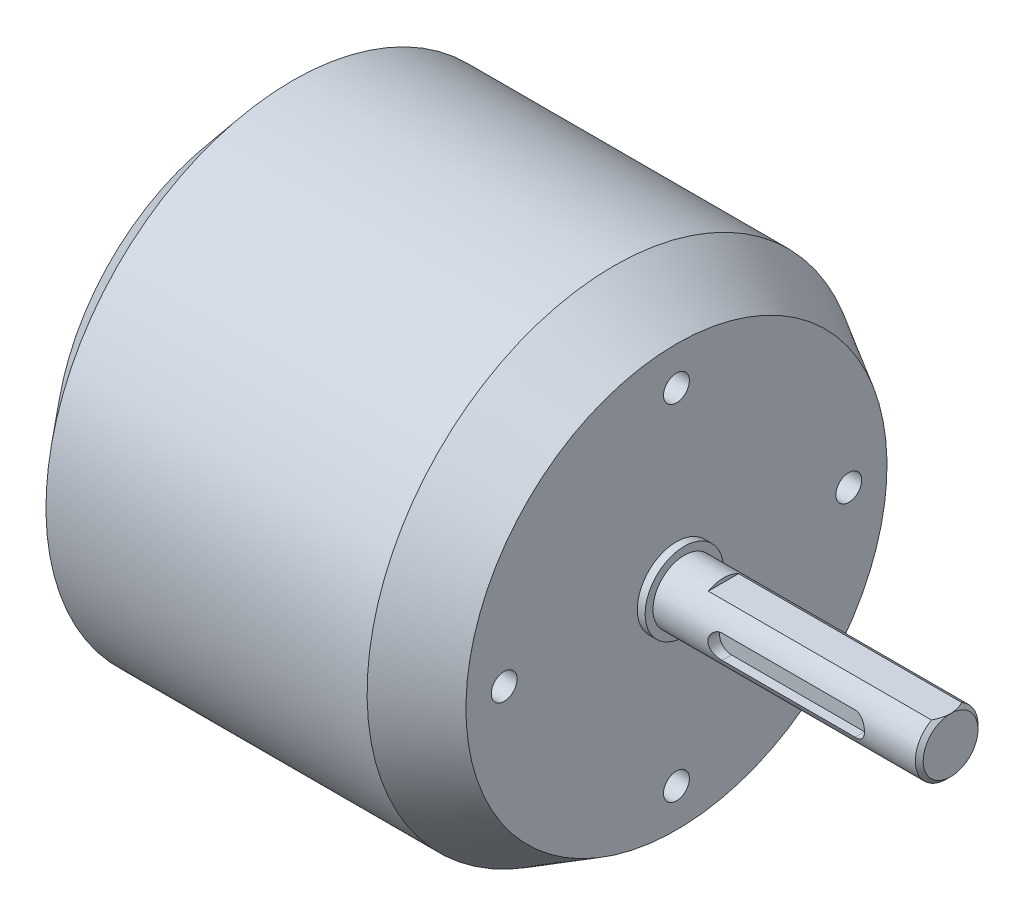
ISO-10303-21;
HEADER;
FILE_DESCRIPTION(('STEP AP214'),'2;1');
FILE_NAME('part.step','',(''),(''),'','','');
FILE_SCHEMA(('AUTOMOTIVE_DESIGN { 1 0 10303 214 1 1 1 1 }'));
ENDSEC;
DATA;
#1=APPLICATION_CONTEXT('core data for automotive mechanical design processes');
#2=APPLICATION_PROTOCOL_DEFINITION('international standard','automotive_design',2000,#1);
#3=PRODUCT_CONTEXT('',#1,'mechanical');
#4=PRODUCT('Part','Part','',(#3));
#5=PRODUCT_RELATED_PRODUCT_CATEGORY('part','',(#4));
#6=PRODUCT_DEFINITION_FORMATION('','',#4);
#7=PRODUCT_DEFINITION_CONTEXT('part definition',#1,'design');
#8=PRODUCT_DEFINITION('design','',#6,#7);
#9=PRODUCT_DEFINITION_SHAPE('','',#8);
#10=(LENGTH_UNIT() NAMED_UNIT(*) SI_UNIT(.MILLI.,.METRE.));
#11=(NAMED_UNIT(*) PLANE_ANGLE_UNIT() SI_UNIT($,.RADIAN.));
#12=(NAMED_UNIT(*) SI_UNIT($,.STERADIAN.) SOLID_ANGLE_UNIT());
#13=UNCERTAINTY_MEASURE_WITH_UNIT(LENGTH_MEASURE(1.E-05),#10,'distance_accuracy_value','');
#14=(GEOMETRIC_REPRESENTATION_CONTEXT(3) GLOBAL_UNCERTAINTY_ASSIGNED_CONTEXT((#13)) GLOBAL_UNIT_ASSIGNED_CONTEXT((#10,
#11,#12)) REPRESENTATION_CONTEXT('',''));
#15=CARTESIAN_POINT('',(0.,0.,0.));
#16=DIRECTION('',(0.,0.,1.));
#17=DIRECTION('',(1.,0.,0.));
#18=AXIS2_PLACEMENT_3D('',#15,#16,#17);
#19=CARTESIAN_POINT('',(-27.5,0.,0.));
#20=DIRECTION('',(-1.,0.,0.));
#21=DIRECTION('',(0.,-1.,0.));
#22=AXIS2_PLACEMENT_3D('',#19,#20,#21);
#23=PLANE('',#22);
#24=CARTESIAN_POINT('',(-27.5,0.,0.));
#25=DIRECTION('',(1.,0.,0.));
#26=DIRECTION('',(0.,1.,0.));
#27=AXIS2_PLACEMENT_3D('',#24,#25,#26);
#28=CIRCLE('',#27,24.3494784444348);
#29=CARTESIAN_POINT('',(-27.5,24.3494784444348,0.));
#30=VERTEX_POINT('',#29);
#31=EDGE_CURVE('E177',#30,#30,#28,.T.);
#32=ORIENTED_EDGE('',*,*,#31,.F.);
#33=EDGE_LOOP('',(#32));
#34=FACE_BOUND('',#33,.T.);
#35=ADVANCED_FACE('F46',(#34),#23,.T.);
#36=CARTESIAN_POINT('',(-21.5,0.,0.));
#37=DIRECTION('',(1.,0.,0.));
#38=DIRECTION('',(0.,1.,0.));
#39=AXIS2_PLACEMENT_3D('',#36,#37,#38);
#40=CONICAL_SURFACE('',#39,31.5,0.872664625997165);
#41=ORIENTED_EDGE('',*,*,#31,.T.);
#42=EDGE_LOOP('',(#41));
#43=FACE_BOUND('',#42,.T.);
#44=CARTESIAN_POINT('',(-21.5,0.,0.));
#45=DIRECTION('',(1.,0.,0.));
#46=DIRECTION('',(0.,1.,0.));
#47=AXIS2_PLACEMENT_3D('',#44,#45,#46);
#48=CIRCLE('',#47,31.5);
#49=CARTESIAN_POINT('',(-21.5,31.5,0.));
#50=VERTEX_POINT('',#49);
#51=EDGE_CURVE('E219',#50,#50,#48,.T.);
#52=ORIENTED_EDGE('',*,*,#51,.F.);
#53=EDGE_LOOP('',(#52));
#54=FACE_BOUND('',#53,.T.);
#55=ADVANCED_FACE('F209',(#43,#54),#40,.T.);
#56=CARTESIAN_POINT('',(27.5,0.,0.));
#57=DIRECTION('',(1.,0.,0.));
#58=DIRECTION('',(0.,1.,0.));
#59=AXIS2_PLACEMENT_3D('',#56,#57,#58);
#60=CYLINDRICAL_SURFACE('',#59,31.5);
#61=ORIENTED_EDGE('',*,*,#51,.T.);
#62=EDGE_LOOP('',(#61));
#63=FACE_BOUND('',#62,.T.);
#64=CARTESIAN_POINT('',(19.5,0.,0.));
#65=DIRECTION('',(1.,0.,0.));
#66=DIRECTION('',(0.,1.,0.));
#67=AXIS2_PLACEMENT_3D('',#64,#65,#66);
#68=CIRCLE('',#67,31.5);
#69=CARTESIAN_POINT('',(19.5,31.5,0.));
#70=VERTEX_POINT('',#69);
#71=EDGE_CURVE('E221',#70,#70,#68,.T.);
#72=ORIENTED_EDGE('',*,*,#71,.F.);
#73=EDGE_LOOP('',(#72));
#74=FACE_BOUND('',#73,.T.);
#75=ADVANCED_FACE('F205',(#63,#74),#60,.T.);
#76=CARTESIAN_POINT('',(27.5,0.,0.));
#77=DIRECTION('',(-1.,0.,0.));
#78=DIRECTION('',(0.,-1.,0.));
#79=AXIS2_PLACEMENT_3D('',#76,#77,#78);
#80=CONICAL_SURFACE('',#79,26.881197846483,0.523598775598296);
#81=ORIENTED_EDGE('',*,*,#71,.T.);
#82=EDGE_LOOP('',(#81));
#83=FACE_BOUND('',#82,.T.);
#84=CARTESIAN_POINT('',(27.5,0.,0.));
#85=DIRECTION('',(1.,0.,0.));
#86=DIRECTION('',(0.,1.,0.));
#87=AXIS2_PLACEMENT_3D('',#84,#85,#86);
#88=CIRCLE('',#87,26.881197846483);
#89=CARTESIAN_POINT('',(27.5,26.881197846483,0.));
#90=VERTEX_POINT('',#89);
#91=EDGE_CURVE('E224',#90,#90,#88,.T.);
#92=ORIENTED_EDGE('',*,*,#91,.F.);
#93=EDGE_LOOP('',(#92));
#94=FACE_BOUND('',#93,.T.);
#95=ADVANCED_FACE('F201',(#83,#94),#80,.T.);
#96=CARTESIAN_POINT('',(27.5,26.881197846483,0.));
#97=DIRECTION('',(1.,0.,0.));
#98=DIRECTION('',(0.,1.,0.));
#99=AXIS2_PLACEMENT_3D('',#96,#97,#98);
#100=PLANE('',#99);
#101=CARTESIAN_POINT('',(27.5,22.,0.));
#102=DIRECTION('',(1.,0.,0.));
#103=DIRECTION('',(0.,0.,-1.));
#104=AXIS2_PLACEMENT_3D('',#101,#102,#103);
#105=CIRCLE('',#104,1.65);
#106=CARTESIAN_POINT('',(27.5,22.,-1.65));
#107=VERTEX_POINT('',#106);
#108=EDGE_CURVE('E259',#107,#107,#105,.T.);
#109=ORIENTED_EDGE('',*,*,#108,.F.);
#110=EDGE_LOOP('',(#109));
#111=FACE_BOUND('',#110,.T.);
#112=CARTESIAN_POINT('',(27.5,-22.,0.));
#113=DIRECTION('',(1.,0.,0.));
#114=DIRECTION('',(0.,0.,-1.));
#115=AXIS2_PLACEMENT_3D('',#112,#113,#114);
#116=CIRCLE('',#115,1.65);
#117=CARTESIAN_POINT('',(27.5,-22.,-1.65));
#118=VERTEX_POINT('',#117);
#119=EDGE_CURVE('E253',#118,#118,#116,.T.);
#120=ORIENTED_EDGE('',*,*,#119,.F.);
#121=EDGE_LOOP('',(#120));
#122=FACE_BOUND('',#121,.T.);
#123=CARTESIAN_POINT('',(27.5,0.,-22.));
#124=DIRECTION('',(1.,0.,0.));
#125=DIRECTION('',(0.,0.,-1.));
#126=AXIS2_PLACEMENT_3D('',#123,#124,#125);
#127=CIRCLE('',#126,1.65);
#128=CARTESIAN_POINT('',(27.5,0.,-23.65));
#129=VERTEX_POINT('',#128);
#130=EDGE_CURVE('E247',#129,#129,#127,.T.);
#131=ORIENTED_EDGE('',*,*,#130,.F.);
#132=EDGE_LOOP('',(#131));
#133=FACE_BOUND('',#132,.T.);
#134=CARTESIAN_POINT('',(27.5,0.,22.));
#135=DIRECTION('',(1.,0.,0.));
#136=DIRECTION('',(0.,0.,-1.));
#137=AXIS2_PLACEMENT_3D('',#134,#135,#136);
#138=CIRCLE('',#137,1.65);
#139=CARTESIAN_POINT('',(27.5,0.,20.35));
#140=VERTEX_POINT('',#139);
#141=EDGE_CURVE('E241',#140,#140,#138,.T.);
#142=ORIENTED_EDGE('',*,*,#141,.F.);
#143=EDGE_LOOP('',(#142));
#144=FACE_BOUND('',#143,.T.);
#145=CARTESIAN_POINT('',(27.5,0.,0.));
#146=DIRECTION('',(1.,0.,0.));
#147=DIRECTION('',(0.,1.,0.));
#148=AXIS2_PLACEMENT_3D('',#145,#146,#147);
#149=CIRCLE('',#148,5.);
#150=CARTESIAN_POINT('',(27.5,5.00000000000001,0.));
#151=VERTEX_POINT('',#150);
#152=EDGE_CURVE('E230',#151,#151,#149,.T.);
#153=ORIENTED_EDGE('',*,*,#152,.F.);
#154=EDGE_LOOP('',(#153));
#155=FACE_BOUND('',#154,.T.);
#156=ORIENTED_EDGE('',*,*,#91,.T.);
#157=EDGE_LOOP('',(#156));
#158=FACE_BOUND('',#157,.T.);
#159=ADVANCED_FACE('F194',(#111,#122,#133,#144,#155,#158),#100,.T.);
#160=CARTESIAN_POINT('',(28.5,0.,0.));
#161=DIRECTION('',(1.,0.,0.));
#162=DIRECTION('',(0.,1.,0.));
#163=AXIS2_PLACEMENT_3D('',#160,#161,#162);
#164=PLANE('',#163);
#165=CARTESIAN_POINT('',(28.5,0.,0.));
#166=DIRECTION('',(1.,0.,0.));
#167=DIRECTION('',(0.,1.,0.));
#168=AXIS2_PLACEMENT_3D('',#165,#166,#167);
#169=CIRCLE('',#168,5.);
#170=CARTESIAN_POINT('',(28.5,5.00000000000001,0.));
#171=VERTEX_POINT('',#170);
#172=EDGE_CURVE('E229',#171,#171,#169,.T.);
#173=ORIENTED_EDGE('',*,*,#172,.T.);
#174=EDGE_LOOP('',(#173));
#175=FACE_BOUND('',#174,.T.);
#176=CARTESIAN_POINT('',(28.5,0.,0.));
#177=DIRECTION('',(1.,0.,0.));
#178=DIRECTION('',(0.,1.,0.));
#179=AXIS2_PLACEMENT_3D('',#176,#177,#178);
#180=CIRCLE('',#179,4.);
#181=CARTESIAN_POINT('',(28.5,4.00000000000001,0.));
#182=VERTEX_POINT('',#181);
#183=EDGE_CURVE('E233',#182,#182,#180,.T.);
#184=ORIENTED_EDGE('',*,*,#183,.F.);
#185=EDGE_LOOP('',(#184));
#186=FACE_BOUND('',#185,.T.);
#187=ADVANCED_FACE('F190',(#175,#186),#164,.T.);
#188=CARTESIAN_POINT('',(28.5,0.,0.));
#189=DIRECTION('',(-1.,0.,0.));
#190=DIRECTION('',(0.,-1.,0.));
#191=AXIS2_PLACEMENT_3D('',#188,#189,#190);
#192=CYLINDRICAL_SURFACE('',#191,5.);
#193=ORIENTED_EDGE('',*,*,#172,.F.);
#194=EDGE_LOOP('',(#193));
#195=FACE_BOUND('',#194,.T.);
#196=ORIENTED_EDGE('',*,*,#152,.T.);
#197=EDGE_LOOP('',(#196));
#198=FACE_BOUND('',#197,.T.);
#199=ADVANCED_FACE('F188',(#195,#198),#192,.T.);
#200=CARTESIAN_POINT('',(62.5,0.,0.));
#201=DIRECTION('',(-1.,0.,0.));
#202=DIRECTION('',(0.,-1.,0.));
#203=AXIS2_PLACEMENT_3D('',#200,#201,#202);
#204=CYLINDRICAL_SURFACE('',#203,4.);
#205=DIRECTION('',(-1.,0.,0.));
#206=VECTOR('',#205,1.);
#207=CARTESIAN_POINT('',(62.5,3.50000000000002,-1.93649167310371));
#208=LINE('',#207,#206);
#209=CARTESIAN_POINT('',(33.5,3.50000000000001,-1.93649167310371));
#210=VERTEX_POINT('',#209);
#211=CARTESIAN_POINT('',(62.,3.50000000000002,-1.93649167310371));
#212=VERTEX_POINT('',#211);
#213=EDGE_CURVE('E111',#210,#212,#208,.F.);
#214=ORIENTED_EDGE('',*,*,#213,.T.);
#215=CARTESIAN_POINT('',(62.,0.,0.));
#216=DIRECTION('',(1.,0.,0.));
#217=DIRECTION('',(0.,1.,0.));
#218=AXIS2_PLACEMENT_3D('',#215,#216,#217);
#219=CIRCLE('',#218,4.);
#220=CARTESIAN_POINT('',(62.,3.50000000000002,1.93649167310371));
#221=VERTEX_POINT('',#220);
#222=EDGE_CURVE('E13',#212,#221,#219,.F.);
#223=ORIENTED_EDGE('',*,*,#222,.T.);
#224=DIRECTION('',(-1.,0.,0.));
#225=VECTOR('',#224,1.);
#226=CARTESIAN_POINT('',(62.5,3.50000000000002,1.93649167310371));
#227=LINE('',#226,#225);
#228=CARTESIAN_POINT('',(33.5,3.50000000000001,1.93649167310371));
#229=VERTEX_POINT('',#228);
#230=EDGE_CURVE('E116',#221,#229,#227,.T.);
#231=ORIENTED_EDGE('',*,*,#230,.T.);
#232=CARTESIAN_POINT('',(33.5,0.,0.));
#233=DIRECTION('',(1.,0.,0.));
#234=DIRECTION('',(0.,1.,0.));
#235=AXIS2_PLACEMENT_3D('',#232,#233,#234);
#236=CIRCLE('',#235,4.);
#237=EDGE_CURVE('E121',#210,#229,#236,.T.);
#238=ORIENTED_EDGE('',*,*,#237,.F.);
#239=EDGE_LOOP('',(#214,#223,#231,#238));
#240=FACE_BOUND('',#239,.T.);
#241=DIRECTION('',(-1.,0.,0.));
#242=VECTOR('',#241,1.);
#243=CARTESIAN_POINT('',(62.5,1.50625,3.70556486078709));
#244=LINE('',#243,#242);
#245=CARTESIAN_POINT('',(37.00625,1.50625,3.70556486078709));
#246=VERTEX_POINT('',#245);
#247=CARTESIAN_POINT('',(53.99375,1.50625,3.70556486078709));
#248=VERTEX_POINT('',#247);
#249=EDGE_CURVE('E126',#246,#248,#244,.F.);
#250=ORIENTED_EDGE('',*,*,#249,.T.);
#251=CARTESIAN_POINT('',(53.99375,1.50625,3.70556486078709));
#252=CARTESIAN_POINT('',(54.0344978928587,1.50625151862187,3.70556000319242));
#253=CARTESIAN_POINT('',(54.075224550686,1.50459543076368,3.70623782920084));
#254=CARTESIAN_POINT('',(54.1563541437584,1.49800041962785,3.70891005643462));
#255=CARTESIAN_POINT('',(54.1967571838838,1.49306260741055,3.71090401206969));
#256=CARTESIAN_POINT('',(54.3167446695935,1.47343167916475,3.71876432059648));
#257=CARTESIAN_POINT('',(54.3954737827407,1.45392039257432,3.72650998337));
#258=CARTESIAN_POINT('',(54.548215470731,1.40280121489189,3.74604926216923));
#259=CARTESIAN_POINT('',(54.6222320124237,1.37120365885237,3.75783941883398));
#260=CARTESIAN_POINT('',(54.7639924221759,1.29689045665855,3.78412808205282));
#261=CARTESIAN_POINT('',(54.8317310427329,1.25416562122484,3.79862882429214));
#262=CARTESIAN_POINT('',(54.9623326748097,1.15653903397746,3.8295103762707));
#263=CARTESIAN_POINT('',(55.0248355957786,1.10117317738226,3.84594660753066));
#264=CARTESIAN_POINT('',(55.1399242842702,0.980820017970887,3.87838535976546));
#265=CARTESIAN_POINT('',(55.1925081253848,0.915830850554564,3.89438779597626));
#266=CARTESIAN_POINT('',(55.288015165729,0.775322334424382,3.92481972319028));
#267=CARTESIAN_POINT('',(55.3305441269141,0.699517796223252,3.93917623139322));
#268=CARTESIAN_POINT('',(55.402094498393,0.541195781997166,3.96402753856521));
#269=CARTESIAN_POINT('',(55.4311209811591,0.458680840575787,3.97452378740602));
#270=CARTESIAN_POINT('',(55.4735731049928,0.293083308106406,3.99007691653776));
#271=CARTESIAN_POINT('',(55.487621850354,0.21018118934451,3.99535033772962));
#272=CARTESIAN_POINT('',(55.5017169648926,0.0430380448204734,4.00064115956656));
#273=CARTESIAN_POINT('',(55.5017676814445,-0.0412025571199564,4.00066019206963));
#274=CARTESIAN_POINT('',(55.4882262997988,-0.204160698394118,3.99557725241587));
#275=CARTESIAN_POINT('',(55.4753146007068,-0.282944131678229,3.99073067675965));
#276=CARTESIAN_POINT('',(55.4373604792364,-0.43713017137373,3.97679673135093));
#277=CARTESIAN_POINT('',(55.4123173679536,-0.512532585522018,3.96770912076451));
#278=CARTESIAN_POINT('',(55.3504982546426,-0.659124720761171,3.94602706784792));
#279=CARTESIAN_POINT('',(55.3135563132457,-0.730236876958312,3.93338336956181));
#280=CARTESIAN_POINT('',(55.2291351595066,-0.865430002595826,3.90586705477555));
#281=CARTESIAN_POINT('',(55.1816525016175,-0.929508662669484,3.89099370996645));
#282=CARTESIAN_POINT('',(55.0742312479238,-1.05281654335902,3.8595159692377));
#283=CARTESIAN_POINT('',(55.0137238880507,-1.11153812471277,3.84286121267211));
#284=CARTESIAN_POINT('',(54.8836107435767,-1.2182017600755,3.81039378706849));
#285=CARTESIAN_POINT('',(54.8140013689853,-1.26613954036616,3.7945814537784));
#286=CARTESIAN_POINT('',(54.6656238983612,-1.35086681394825,3.76526504425048));
#287=CARTESIAN_POINT('',(54.5866816719908,-1.38737385754036,3.75182257724866));
#288=CARTESIAN_POINT('',(54.4231705202884,-1.4463431944906,3.7294906507126));
#289=CARTESIAN_POINT('',(54.3386113475935,-1.46882916184113,3.72059352118497));
#290=CARTESIAN_POINT('',(54.2099520843889,-1.49128530286961,3.71162033361973));
#291=CARTESIAN_POINT('',(54.1669178370747,-1.49689170989974,3.70935839804656));
#292=CARTESIAN_POINT('',(54.0805141812521,-1.50437328985137,3.70632824691668));
#293=CARTESIAN_POINT('',(54.0371451148144,-1.50625186648456,3.7055586687712));
#294=CARTESIAN_POINT('',(53.99375,-1.50625,3.70556486078708));
#295=B_SPLINE_CURVE_WITH_KNOTS('',3,(#251,#252,#253,#254,#255,#256,#257,#258,#259,#260,#261,
#262,#263,#264,#265,#266,#267,#268,#269,#270,#271,#272,#273,#274,#275,#276,#277,#278,#279,#280,
#281,#282,#283,#284,#285,#286,#287,#288,#289,#290,#291,#292,#293,#294),.UNSPECIFIED.,.F.,.F.,(4,
2,2,2,2,2,2,2,2,2,2,2,2,2,2,2,2,2,2,2,2,4),(0.,0.122163184634656,0.244285030766624,
0.487444695775524,0.730396896431479,0.973550374877426,1.22772355647032,1.4819460509257,
1.74490779361182,2.00777066959622,2.25921121114931,2.51057366260607,2.74939775522216,
2.98823541149402,3.23055960591128,3.47296312814912,3.72963844832239,3.98641531274745,
4.24911111882277,4.51136216450914,4.64156860607659,4.77165610728607),.UNSPECIFIED.);
#296=CARTESIAN_POINT('',(53.99375,-1.50625,3.70556486078708));
#297=VERTEX_POINT('',#296);
#298=EDGE_CURVE('E167',#248,#297,#295,.T.);
#299=ORIENTED_EDGE('',*,*,#298,.T.);
#300=DIRECTION('',(-1.,0.,0.));
#301=VECTOR('',#300,1.);
#302=CARTESIAN_POINT('',(62.5,-1.50625,3.70556486078708));
#303=LINE('',#302,#301);
#304=CARTESIAN_POINT('',(37.00625,-1.50625,3.70556486078708));
#305=VERTEX_POINT('',#304);
#306=EDGE_CURVE('E132',#297,#305,#303,.T.);
#307=ORIENTED_EDGE('',*,*,#306,.T.);
#308=CARTESIAN_POINT('',(37.00625,-1.50625,3.70556486078708));
#309=CARTESIAN_POINT('',(36.9655021071413,-1.50625151862187,3.70556000319241));
#310=CARTESIAN_POINT('',(36.924775449314,-1.50459543076367,3.70623782920083));
#311=CARTESIAN_POINT('',(36.8436458562416,-1.49800041962785,3.70891005643461));
#312=CARTESIAN_POINT('',(36.8032428161162,-1.49306260741055,3.71090401206968));
#313=CARTESIAN_POINT('',(36.6832553304065,-1.47343167916475,3.71876432059647));
#314=CARTESIAN_POINT('',(36.6045262172593,-1.45392039257432,3.72650998336999));
#315=CARTESIAN_POINT('',(36.451784529269,-1.40280121489189,3.74604926216922));
#316=CARTESIAN_POINT('',(36.3777679875763,-1.37120365885237,3.75783941883397));
#317=CARTESIAN_POINT('',(36.2360075778241,-1.29689045665855,3.78412808205281));
#318=CARTESIAN_POINT('',(36.1682689572671,-1.25416562122484,3.79862882429213));
#319=CARTESIAN_POINT('',(36.0376673251903,-1.15653903397746,3.82951037627069));
#320=CARTESIAN_POINT('',(35.9751644042213,-1.10117317738226,3.84594660753065));
#321=CARTESIAN_POINT('',(35.8600757157298,-0.980820017970886,3.87838535976545));
#322=CARTESIAN_POINT('',(35.8074918746151,-0.915830850554563,3.89438779597625));
#323=CARTESIAN_POINT('',(35.711984834271,-0.775322334424381,3.92481972319028));
#324=CARTESIAN_POINT('',(35.6694558730859,-0.69951779622325,3.93917623139322));
#325=CARTESIAN_POINT('',(35.597905501607,-0.541195781997167,3.96402753856521));
#326=CARTESIAN_POINT('',(35.5688790188409,-0.45868084057579,3.97452378740602));
#327=CARTESIAN_POINT('',(35.5264268950072,-0.293083308106412,3.99007691653776));
#328=CARTESIAN_POINT('',(35.512378149646,-0.210181189344516,3.99535033772961));
#329=CARTESIAN_POINT('',(35.4982830351074,-0.0430380448204794,4.00064115956656));
#330=CARTESIAN_POINT('',(35.4982323185555,0.0412025571199502,4.00066019206963));
#331=CARTESIAN_POINT('',(35.5117737002012,0.204160698394112,3.99557725241587));
#332=CARTESIAN_POINT('',(35.5246853992932,0.282944131678224,3.99073067675966));
#333=CARTESIAN_POINT('',(35.5626395207636,0.437130171373726,3.97679673135093));
#334=CARTESIAN_POINT('',(35.5876826320464,0.512532585522014,3.96770912076452));
#335=CARTESIAN_POINT('',(35.6495017453574,0.659124720761168,3.94602706784792));
#336=CARTESIAN_POINT('',(35.6864436867543,0.73023687695831,3.93338336956181));
#337=CARTESIAN_POINT('',(35.7708648404934,0.865430002595825,3.90586705477556));
#338=CARTESIAN_POINT('',(35.8183474983825,0.929508662669482,3.89099370996646));
#339=CARTESIAN_POINT('',(35.9257687520762,1.05281654335902,3.85951596923771));
#340=CARTESIAN_POINT('',(35.9862761119493,1.11153812471277,3.84286121267211));
#341=CARTESIAN_POINT('',(36.1163892564233,1.2182017600755,3.8103937870685));
#342=CARTESIAN_POINT('',(36.1859986310147,1.26613954036616,3.79458145377841));
#343=CARTESIAN_POINT('',(36.3343761016388,1.35086681394825,3.76526504425049));
#344=CARTESIAN_POINT('',(36.4133183280092,1.38737385754035,3.75182257724867));
#345=CARTESIAN_POINT('',(36.5768294797116,1.4463431944906,3.72949065071262));
#346=CARTESIAN_POINT('',(36.6613886524065,1.46882916184113,3.72059352118498));
#347=CARTESIAN_POINT('',(36.7900479156111,1.49128530286961,3.71162033361974));
#348=CARTESIAN_POINT('',(36.8330821629252,1.49689170989974,3.70935839804657));
#349=CARTESIAN_POINT('',(36.9194858187479,1.50437328985137,3.7063282469167));
#350=CARTESIAN_POINT('',(36.9628548851856,1.50625186648457,3.70555866877121));
#351=CARTESIAN_POINT('',(37.00625,1.50625,3.70556486078709));
#352=B_SPLINE_CURVE_WITH_KNOTS('',3,(#308,#309,#310,#311,#312,#313,#314,#315,#316,#317,#318,
#319,#320,#321,#322,#323,#324,#325,#326,#327,#328,#329,#330,#331,#332,#333,#334,#335,#336,#337,
#338,#339,#340,#341,#342,#343,#344,#345,#346,#347,#348,#349,#350,#351),.UNSPECIFIED.,.F.,.F.,(4,
2,2,2,2,2,2,2,2,2,2,2,2,2,2,2,2,2,2,2,2,4),(0.,0.122163184634656,0.244285030766624,
0.487444695775516,0.730396896431479,0.973550374877417,1.22772355647032,1.4819460509257,
1.74490779361181,2.00777066959621,2.2592112111493,2.51057366260606,2.74939775522216,
2.98823541149401,3.23055960591127,3.47296312814911,3.72963844832239,3.98641531274744,
4.24911111882276,4.51136216450912,4.64156860607659,4.77165610728607),.UNSPECIFIED.);
#353=EDGE_CURVE('E176',#305,#246,#352,.T.);
#354=ORIENTED_EDGE('',*,*,#353,.T.);
#355=EDGE_LOOP('',(#250,#299,#307,#354));
#356=FACE_BOUND('',#355,.T.);
#357=ORIENTED_EDGE('',*,*,#183,.T.);
#358=EDGE_LOOP('',(#357));
#359=FACE_BOUND('',#358,.T.);
#360=ADVANCED_FACE('F123',(#240,#356,#359),#204,.T.);
#361=CARTESIAN_POINT('',(62.5,0.,0.));
#362=DIRECTION('',(1.,0.,0.));
#363=DIRECTION('',(0.,1.,0.));
#364=AXIS2_PLACEMENT_3D('',#361,#362,#363);
#365=PLANE('',#364);
#366=CARTESIAN_POINT('',(62.5,0.,0.));
#367=DIRECTION('',(1.,0.,0.));
#368=DIRECTION('',(0.,1.,0.));
#369=AXIS2_PLACEMENT_3D('',#366,#367,#368);
#370=CIRCLE('',#369,3.49999999999999);
#371=CARTESIAN_POINT('',(62.5,3.50000000000002,0.));
#372=VERTEX_POINT('',#371);
#373=EDGE_CURVE('E125',#372,#372,#370,.T.);
#374=ORIENTED_EDGE('',*,*,#373,.T.);
#375=EDGE_LOOP('',(#374));
#376=FACE_BOUND('',#375,.T.);
#377=ADVANCED_FACE('F187',(#376),#365,.T.);
#378=CARTESIAN_POINT('',(17.5,0.,22.));
#379=DIRECTION('',(1.,0.,0.));
#380=DIRECTION('',(0.,0.,-1.));
#381=AXIS2_PLACEMENT_3D('',#378,#379,#380);
#382=CONICAL_SURFACE('',#381,1.65,1.02974425867665);
#383=CARTESIAN_POINT('',(16.5085799786045,0.,22.));
#384=VERTEX_POINT('',#383);
#385=VERTEX_LOOP('',#384);
#386=FACE_BOUND('',#385,.T.);
#387=CARTESIAN_POINT('',(17.5,0.,22.));
#388=DIRECTION('',(1.,0.,0.));
#389=DIRECTION('',(0.,0.,-1.));
#390=AXIS2_PLACEMENT_3D('',#387,#388,#389);
#391=CIRCLE('',#390,1.65);
#392=CARTESIAN_POINT('',(17.5,0.,20.35));
#393=VERTEX_POINT('',#392);
#394=EDGE_CURVE('E238',#393,#393,#391,.T.);
#395=ORIENTED_EDGE('',*,*,#394,.T.);
#396=EDGE_LOOP('',(#395));
#397=FACE_BOUND('',#396,.T.);
#398=ADVANCED_FACE('F337',(#386,#397),#382,.F.);
#399=CARTESIAN_POINT('',(27.5,0.,22.));
#400=DIRECTION('',(1.,0.,0.));
#401=DIRECTION('',(0.,0.,-1.));
#402=AXIS2_PLACEMENT_3D('',#399,#400,#401);
#403=CYLINDRICAL_SURFACE('',#402,1.65);
#404=ORIENTED_EDGE('',*,*,#394,.F.);
#405=EDGE_LOOP('',(#404));
#406=FACE_BOUND('',#405,.T.);
#407=ORIENTED_EDGE('',*,*,#141,.T.);
#408=EDGE_LOOP('',(#407));
#409=FACE_BOUND('',#408,.T.);
#410=ADVANCED_FACE('F400',(#406,#409),#403,.F.);
#411=CARTESIAN_POINT('',(17.5,0.,-22.));
#412=DIRECTION('',(1.,0.,0.));
#413=DIRECTION('',(0.,0.,-1.));
#414=AXIS2_PLACEMENT_3D('',#411,#412,#413);
#415=CONICAL_SURFACE('',#414,1.65,1.02974425867665);
#416=CARTESIAN_POINT('',(16.5085799786045,0.,-22.));
#417=VERTEX_POINT('',#416);
#418=VERTEX_LOOP('',#417);
#419=FACE_BOUND('',#418,.T.);
#420=CARTESIAN_POINT('',(17.5,0.,-22.));
#421=DIRECTION('',(1.,0.,0.));
#422=DIRECTION('',(0.,0.,-1.));
#423=AXIS2_PLACEMENT_3D('',#420,#421,#422);
#424=CIRCLE('',#423,1.65);
#425=CARTESIAN_POINT('',(17.5,0.,-23.65));
#426=VERTEX_POINT('',#425);
#427=EDGE_CURVE('E244',#426,#426,#424,.T.);
#428=ORIENTED_EDGE('',*,*,#427,.T.);
#429=EDGE_LOOP('',(#428));
#430=FACE_BOUND('',#429,.T.);
#431=ADVANCED_FACE('F410',(#419,#430),#415,.F.);
#432=CARTESIAN_POINT('',(27.5,0.,-22.));
#433=DIRECTION('',(1.,0.,0.));
#434=DIRECTION('',(0.,0.,-1.));
#435=AXIS2_PLACEMENT_3D('',#432,#433,#434);
#436=CYLINDRICAL_SURFACE('',#435,1.65);
#437=ORIENTED_EDGE('',*,*,#427,.F.);
#438=EDGE_LOOP('',(#437));
#439=FACE_BOUND('',#438,.T.);
#440=ORIENTED_EDGE('',*,*,#130,.T.);
#441=EDGE_LOOP('',(#440));
#442=FACE_BOUND('',#441,.T.);
#443=ADVANCED_FACE('F422',(#439,#442),#436,.F.);
#444=CARTESIAN_POINT('',(17.5,-22.,0.));
#445=DIRECTION('',(1.,0.,0.));
#446=DIRECTION('',(0.,0.,-1.));
#447=AXIS2_PLACEMENT_3D('',#444,#445,#446);
#448=CONICAL_SURFACE('',#447,1.65,1.02974425867665);
#449=CARTESIAN_POINT('',(16.5085799786045,-22.,0.));
#450=VERTEX_POINT('',#449);
#451=VERTEX_LOOP('',#450);
#452=FACE_BOUND('',#451,.T.);
#453=CARTESIAN_POINT('',(17.5,-22.,0.));
#454=DIRECTION('',(1.,0.,0.));
#455=DIRECTION('',(0.,0.,-1.));
#456=AXIS2_PLACEMENT_3D('',#453,#454,#455);
#457=CIRCLE('',#456,1.65);
#458=CARTESIAN_POINT('',(17.5,-22.,-1.65));
#459=VERTEX_POINT('',#458);
#460=EDGE_CURVE('E250',#459,#459,#457,.T.);
#461=ORIENTED_EDGE('',*,*,#460,.T.);
#462=EDGE_LOOP('',(#461));
#463=FACE_BOUND('',#462,.T.);
#464=ADVANCED_FACE('F432',(#452,#463),#448,.F.);
#465=CARTESIAN_POINT('',(27.5,-22.,0.));
#466=DIRECTION('',(1.,0.,0.));
#467=DIRECTION('',(0.,0.,-1.));
#468=AXIS2_PLACEMENT_3D('',#465,#466,#467);
#469=CYLINDRICAL_SURFACE('',#468,1.65);
#470=ORIENTED_EDGE('',*,*,#460,.F.);
#471=EDGE_LOOP('',(#470));
#472=FACE_BOUND('',#471,.T.);
#473=ORIENTED_EDGE('',*,*,#119,.T.);
#474=EDGE_LOOP('',(#473));
#475=FACE_BOUND('',#474,.T.);
#476=ADVANCED_FACE('F444',(#472,#475),#469,.F.);
#477=CARTESIAN_POINT('',(17.5,22.,0.));
#478=DIRECTION('',(1.,0.,0.));
#479=DIRECTION('',(0.,0.,-1.));
#480=AXIS2_PLACEMENT_3D('',#477,#478,#479);
#481=CONICAL_SURFACE('',#480,1.65,1.02974425867665);
#482=CARTESIAN_POINT('',(16.5085799786045,22.,0.));
#483=VERTEX_POINT('',#482);
#484=VERTEX_LOOP('',#483);
#485=FACE_BOUND('',#484,.T.);
#486=CARTESIAN_POINT('',(17.5,22.,0.));
#487=DIRECTION('',(1.,0.,0.));
#488=DIRECTION('',(0.,0.,-1.));
#489=AXIS2_PLACEMENT_3D('',#486,#487,#488);
#490=CIRCLE('',#489,1.65);
#491=CARTESIAN_POINT('',(17.5,22.,-1.65));
#492=VERTEX_POINT('',#491);
#493=EDGE_CURVE('E256',#492,#492,#490,.T.);
#494=ORIENTED_EDGE('',*,*,#493,.T.);
#495=EDGE_LOOP('',(#494));
#496=FACE_BOUND('',#495,.T.);
#497=ADVANCED_FACE('F454',(#485,#496),#481,.F.);
#498=CARTESIAN_POINT('',(27.5,22.,0.));
#499=DIRECTION('',(1.,0.,0.));
#500=DIRECTION('',(0.,0.,-1.));
#501=AXIS2_PLACEMENT_3D('',#498,#499,#500);
#502=CYLINDRICAL_SURFACE('',#501,1.65);
#503=ORIENTED_EDGE('',*,*,#493,.F.);
#504=EDGE_LOOP('',(#503));
#505=FACE_BOUND('',#504,.T.);
#506=ORIENTED_EDGE('',*,*,#108,.T.);
#507=EDGE_LOOP('',(#506));
#508=FACE_BOUND('',#507,.T.);
#509=ADVANCED_FACE('F465',(#505,#508),#502,.F.);
#510=CARTESIAN_POINT('',(37.00625,0.,2.5));
#511=DIRECTION('',(0.,0.,1.));
#512=DIRECTION('',(1.,0.,0.));
#513=AXIS2_PLACEMENT_3D('',#510,#511,#512);
#514=CYLINDRICAL_SURFACE('',#513,1.50625);
#515=DIRECTION('',(0.,0.,1.));
#516=VECTOR('',#515,1.);
#517=CARTESIAN_POINT('',(37.00625,-1.50625,2.5));
#518=LINE('',#517,#516);
#519=CARTESIAN_POINT('',(37.00625,-1.50625,2.5));
#520=VERTEX_POINT('',#519);
#521=EDGE_CURVE('E263',#520,#305,#518,.T.);
#522=ORIENTED_EDGE('',*,*,#521,.F.);
#523=CARTESIAN_POINT('',(37.00625,0.,2.5));
#524=DIRECTION('',(0.,0.,1.));
#525=DIRECTION('',(1.,0.,0.));
#526=AXIS2_PLACEMENT_3D('',#523,#524,#525);
#527=CIRCLE('',#526,1.50625);
#528=CARTESIAN_POINT('',(37.00625,1.50625,2.5));
#529=VERTEX_POINT('',#528);
#530=EDGE_CURVE('E283',#529,#520,#527,.T.);
#531=ORIENTED_EDGE('',*,*,#530,.F.);
#532=DIRECTION('',(0.,0.,1.));
#533=VECTOR('',#532,1.);
#534=CARTESIAN_POINT('',(37.00625,1.50625,2.5));
#535=LINE('',#534,#533);
#536=EDGE_CURVE('E262',#529,#246,#535,.T.);
#537=ORIENTED_EDGE('',*,*,#536,.T.);
#538=ORIENTED_EDGE('',*,*,#353,.F.);
#539=EDGE_LOOP('',(#522,#531,#537,#538));
#540=FACE_BOUND('',#539,.T.);
#541=ADVANCED_FACE('F159',(#540),#514,.F.);
#542=CARTESIAN_POINT('',(37.00625,1.50625,2.5));
#543=DIRECTION('',(0.,1.,0.));
#544=DIRECTION('',(-1.,0.,0.));
#545=AXIS2_PLACEMENT_3D('',#542,#543,#544);
#546=PLANE('',#545);
#547=ORIENTED_EDGE('',*,*,#536,.F.);
#548=DIRECTION('',(-1.,0.,0.));
#549=VECTOR('',#548,1.);
#550=CARTESIAN_POINT('',(37.00625,1.50625,2.5));
#551=LINE('',#550,#549);
#552=CARTESIAN_POINT('',(53.99375,1.50625,2.5));
#553=VERTEX_POINT('',#552);
#554=EDGE_CURVE('E267',#553,#529,#551,.T.);
#555=ORIENTED_EDGE('',*,*,#554,.F.);
#556=DIRECTION('',(0.,0.,1.));
#557=VECTOR('',#556,1.);
#558=CARTESIAN_POINT('',(53.99375,1.50625,2.5));
#559=LINE('',#558,#557);
#560=EDGE_CURVE('E270',#553,#248,#559,.T.);
#561=ORIENTED_EDGE('',*,*,#560,.T.);
#562=ORIENTED_EDGE('',*,*,#249,.F.);
#563=EDGE_LOOP('',(#547,#555,#561,#562));
#564=FACE_BOUND('',#563,.T.);
#565=ADVANCED_FACE('F155',(#564),#546,.F.);
#566=CARTESIAN_POINT('',(53.99375,0.,2.5));
#567=DIRECTION('',(0.,0.,1.));
#568=DIRECTION('',(1.,0.,0.));
#569=AXIS2_PLACEMENT_3D('',#566,#567,#568);
#570=CYLINDRICAL_SURFACE('',#569,1.50625);
#571=ORIENTED_EDGE('',*,*,#560,.F.);
#572=CARTESIAN_POINT('',(53.99375,0.,2.5));
#573=DIRECTION('',(0.,0.,1.));
#574=DIRECTION('',(1.,0.,0.));
#575=AXIS2_PLACEMENT_3D('',#572,#573,#574);
#576=CIRCLE('',#575,1.50625);
#577=CARTESIAN_POINT('',(53.99375,-1.50625,2.5));
#578=VERTEX_POINT('',#577);
#579=EDGE_CURVE('E277',#578,#553,#576,.T.);
#580=ORIENTED_EDGE('',*,*,#579,.F.);
#581=DIRECTION('',(0.,0.,1.));
#582=VECTOR('',#581,1.);
#583=CARTESIAN_POINT('',(53.99375,-1.50625,2.5));
#584=LINE('',#583,#582);
#585=EDGE_CURVE('E266',#578,#297,#584,.T.);
#586=ORIENTED_EDGE('',*,*,#585,.T.);
#587=ORIENTED_EDGE('',*,*,#298,.F.);
#588=EDGE_LOOP('',(#571,#580,#586,#587));
#589=FACE_BOUND('',#588,.T.);
#590=ADVANCED_FACE('F158',(#589),#570,.F.);
#591=CARTESIAN_POINT('',(37.00625,-1.50625,2.5));
#592=DIRECTION('',(0.,-1.,0.));
#593=DIRECTION('',(1.,0.,0.));
#594=AXIS2_PLACEMENT_3D('',#591,#592,#593);
#595=PLANE('',#594);
#596=ORIENTED_EDGE('',*,*,#585,.F.);
#597=DIRECTION('',(1.,0.,0.));
#598=VECTOR('',#597,1.);
#599=CARTESIAN_POINT('',(37.00625,-1.50625,2.5));
#600=LINE('',#599,#598);
#601=EDGE_CURVE('E280',#520,#578,#600,.T.);
#602=ORIENTED_EDGE('',*,*,#601,.F.);
#603=ORIENTED_EDGE('',*,*,#521,.T.);
#604=ORIENTED_EDGE('',*,*,#306,.F.);
#605=EDGE_LOOP('',(#596,#602,#603,#604));
#606=FACE_BOUND('',#605,.T.);
#607=ADVANCED_FACE('F153',(#606),#595,.F.);
#608=CARTESIAN_POINT('',(37.00625,0.,2.5));
#609=DIRECTION('',(0.,0.,1.));
#610=DIRECTION('',(1.,0.,0.));
#611=AXIS2_PLACEMENT_3D('',#608,#609,#610);
#612=PLANE('',#611);
#613=ORIENTED_EDGE('',*,*,#530,.T.);
#614=ORIENTED_EDGE('',*,*,#601,.T.);
#615=ORIENTED_EDGE('',*,*,#579,.T.);
#616=ORIENTED_EDGE('',*,*,#554,.T.);
#617=EDGE_LOOP('',(#613,#614,#615,#616));
#618=FACE_BOUND('',#617,.T.);
#619=ADVANCED_FACE('F149',(#618),#612,.T.);
#620=CARTESIAN_POINT('',(33.5,0.,0.));
#621=DIRECTION('',(1.,0.,0.));
#622=DIRECTION('',(0.,1.,0.));
#623=AXIS2_PLACEMENT_3D('',#620,#621,#622);
#624=PLANE('',#623);
#625=ORIENTED_EDGE('',*,*,#237,.T.);
#626=DIRECTION('',(0.,0.,1.));
#627=VECTOR('',#626,1.);
#628=CARTESIAN_POINT('',(33.5,3.50000000000001,4.));
#629=LINE('',#628,#627);
#630=EDGE_CURVE('E114',#210,#229,#629,.T.);
#631=ORIENTED_EDGE('',*,*,#630,.F.);
#632=EDGE_LOOP('',(#625,#631));
#633=FACE_BOUND('',#632,.T.);
#634=ADVANCED_FACE('F120',(#633),#624,.T.);
#635=CARTESIAN_POINT('',(19.7102628587275,3.50000000000001,4.));
#636=DIRECTION('',(0.,-1.,0.));
#637=DIRECTION('',(1.,0.,0.));
#638=AXIS2_PLACEMENT_3D('',#635,#636,#637);
#639=PLANE('',#638);
#640=CARTESIAN_POINT('',(62.,3.50000000000002,1.93649167310371));
#641=CARTESIAN_POINT('',(62.0652372637352,3.50000000000002,1.80164497176727));
#642=CARTESIAN_POINT('',(62.1264247933217,3.50000000000002,1.66457098308316));
#643=CARTESIAN_POINT('',(62.2380432456296,3.50000000000002,1.38524046220892));
#644=CARTESIAN_POINT('',(62.2884107198308,3.50000000000002,1.24295879634618));
#645=CARTESIAN_POINT('',(62.3737391296379,3.50000000000002,0.957964142076929));
#646=CARTESIAN_POINT('',(62.4090825232625,3.50000000000002,0.815368580178089));
#647=CARTESIAN_POINT('',(62.4633017124559,3.50000000000002,0.527355180962326));
#648=CARTESIAN_POINT('',(62.4822233433702,3.50000000000002,0.381946364669763));
#649=CARTESIAN_POINT('',(62.4946920194637,3.50000000000002,0.196806714012766));
#650=CARTESIAN_POINT('',(62.4966762102459,3.50000000000002,0.157558468243247));
#651=CARTESIAN_POINT('',(62.4993319828856,3.50000000000002,0.078875883891072));
#652=CARTESIAN_POINT('',(62.4999988043633,3.50000000000002,0.0394413847077913));
#653=CARTESIAN_POINT('',(62.5,3.50000000000002,0.));
#654=B_SPLINE_CURVE_WITH_KNOTS('',3,(#640,#641,#642,#643,#644,#645,#646,#647,#648,#649,#650,
#651,#652,#653),.UNSPECIFIED.,.F.,.F.,(4,2,2,2,2,2,4),(0.,0.449696578012136,0.901962231908622,
1.34190254514452,1.78061093996755,1.89849062730154,2.01679550527431),.UNSPECIFIED.);
#655=EDGE_CURVE('E129',#221,#372,#654,.T.);
#656=ORIENTED_EDGE('',*,*,#655,.T.);
#657=CARTESIAN_POINT('',(62.5,3.50000000000001,0.));
#658=CARTESIAN_POINT('',(62.5000042992206,3.50000000000001,-0.0537467282966517));
#659=CARTESIAN_POINT('',(62.4987613592206,3.50000000000002,-0.107485412101765));
#660=CARTESIAN_POINT('',(62.4938215150662,3.50000000000002,-0.214841712901819));
#661=CARTESIAN_POINT('',(62.4901249951408,3.50000000000002,-0.268459347534039));
#662=CARTESIAN_POINT('',(62.475434232121,3.50000000000002,-0.428791077671273));
#663=CARTESIAN_POINT('',(62.4608384718383,3.50000000000002,-0.535193061064617));
#664=CARTESIAN_POINT('',(62.423095942336,3.50000000000002,-0.744803501539093));
#665=CARTESIAN_POINT('',(62.4000786705785,3.50000000000002,-0.848035915186238));
#666=CARTESIAN_POINT('',(62.3464954848622,3.50000000000002,-1.05253938951657));
#667=CARTESIAN_POINT('',(62.3159274562102,3.50000000000002,-1.15380989215634));
#668=CARTESIAN_POINT('',(62.2625458023908,3.50000000000002,-1.3120819683169));
#669=CARTESIAN_POINT('',(62.2418648294237,3.50000000000002,-1.36981851759888));
#670=CARTESIAN_POINT('',(62.1985481636117,3.50000000000002,-1.48453880356189));
#671=CARTESIAN_POINT('',(62.1759129543519,3.50000000000002,-1.54152272248365));
#672=CARTESIAN_POINT('',(62.1286701953964,3.50000000000002,-1.65526327998892));
#673=CARTESIAN_POINT('',(62.104046774525,3.50000000000002,-1.7120132944665));
#674=CARTESIAN_POINT('',(62.0531872844981,3.50000000000002,-1.82479000868547));
#675=CARTESIAN_POINT('',(62.0269511432462,3.50000000000002,-1.8808166759541));
#676=CARTESIAN_POINT('',(62.,3.50000000000002,-1.93649167310371));
#677=B_SPLINE_CURVE_WITH_KNOTS('',3,(#657,#658,#659,#660,#661,#662,#663,#664,#665,#666,#667,
#668,#669,#670,#671,#672,#673,#674,#675,#676),.UNSPECIFIED.,.F.,.F.,(4,2,2,2,2,2,2,2,2,4),(0.,
0.161210431703249,0.322395623915892,0.644141179095839,0.961134016818498,1.2782157335994,
1.46217088394501,1.64608064347331,1.83164013593089,2.01720792982577),.UNSPECIFIED.);
#678=EDGE_CURVE('E56',#372,#212,#677,.T.);
#679=ORIENTED_EDGE('',*,*,#678,.T.);
#680=ORIENTED_EDGE('',*,*,#213,.F.);
#681=ORIENTED_EDGE('',*,*,#630,.T.);
#682=ORIENTED_EDGE('',*,*,#230,.F.);
#683=EDGE_LOOP('',(#656,#679,#680,#681,#682));
#684=FACE_BOUND('',#683,.T.);
#685=ADVANCED_FACE('F113',(#684),#639,.F.);
#686=CARTESIAN_POINT('',(62.5,0.,0.));
#687=DIRECTION('',(-1.,0.,0.));
#688=DIRECTION('',(0.,-1.,0.));
#689=AXIS2_PLACEMENT_3D('',#686,#687,#688);
#690=CONICAL_SURFACE('',#689,3.49999999999999,0.785398163397432);
#691=ORIENTED_EDGE('',*,*,#655,.F.);
#692=ORIENTED_EDGE('',*,*,#222,.F.);
#693=ORIENTED_EDGE('',*,*,#678,.F.);
#694=ORIENTED_EDGE('',*,*,#373,.F.);
#695=EDGE_LOOP('',(#691,#692,#693,#694));
#696=FACE_BOUND('',#695,.T.);
#697=ADVANCED_FACE('F49',(#696),#690,.T.);
#698=CLOSED_SHELL('',(#35,#55,#75,#95,#159,#187,#199,#360,#377,#398,#410,#431,#443,#464,#476,
#497,#509,#541,#565,#590,#607,#619,#634,#685,#697));
#699=MANIFOLD_SOLID_BREP('B2',#698);
#700=ADVANCED_BREP_SHAPE_REPRESENTATION('',(#18,#699),#14);
#701=SHAPE_DEFINITION_REPRESENTATION(#9,#700);
ENDSEC;
END-ISO-10303-21;
